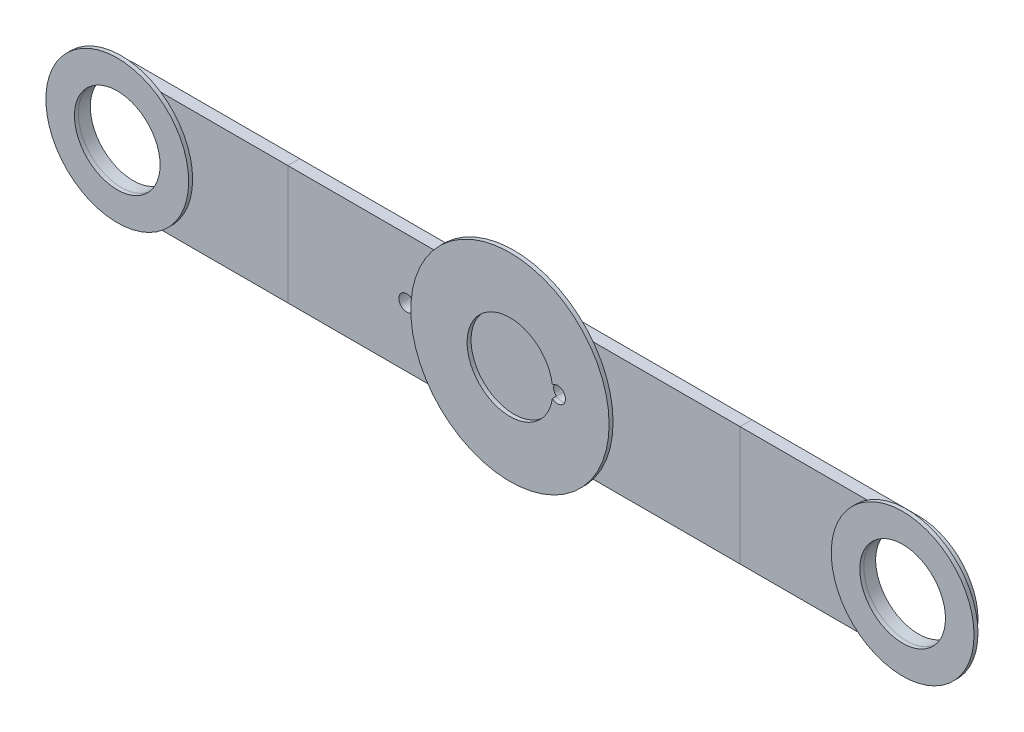
ISO-10303-21;
HEADER;
FILE_DESCRIPTION(('STEP AP214'),'2;1');
FILE_NAME('part.step','',(''),(''),'','','');
FILE_SCHEMA(('AUTOMOTIVE_DESIGN { 1 0 10303 214 1 1 1 1 }'));
ENDSEC;
DATA;
#1=APPLICATION_CONTEXT('core data for automotive mechanical design processes');
#2=APPLICATION_PROTOCOL_DEFINITION('international standard','automotive_design',2000,#1);
#3=PRODUCT_CONTEXT('',#1,'mechanical');
#4=PRODUCT('Part','Part','',(#3));
#5=PRODUCT_RELATED_PRODUCT_CATEGORY('part','',(#4));
#6=PRODUCT_DEFINITION_FORMATION('','',#4);
#7=PRODUCT_DEFINITION_CONTEXT('part definition',#1,'design');
#8=PRODUCT_DEFINITION('design','',#6,#7);
#9=PRODUCT_DEFINITION_SHAPE('','',#8);
#10=(LENGTH_UNIT() NAMED_UNIT(*) SI_UNIT(.MILLI.,.METRE.));
#11=(NAMED_UNIT(*) PLANE_ANGLE_UNIT() SI_UNIT($,.RADIAN.));
#12=(NAMED_UNIT(*) SI_UNIT($,.STERADIAN.) SOLID_ANGLE_UNIT());
#13=UNCERTAINTY_MEASURE_WITH_UNIT(LENGTH_MEASURE(1.E-05),#10,'distance_accuracy_value','');
#14=(GEOMETRIC_REPRESENTATION_CONTEXT(3) GLOBAL_UNCERTAINTY_ASSIGNED_CONTEXT((#13)) GLOBAL_UNIT_ASSIGNED_CONTEXT((#10,
#11,#12)) REPRESENTATION_CONTEXT('',''));
#15=CARTESIAN_POINT('',(0.,0.,0.));
#16=DIRECTION('',(0.,0.,1.));
#17=DIRECTION('',(1.,0.,0.));
#18=AXIS2_PLACEMENT_3D('',#15,#16,#17);
#19=CARTESIAN_POINT('',(0.,0.,0.));
#20=DIRECTION('',(0.,0.,1.));
#21=DIRECTION('',(1.,0.,0.));
#22=AXIS2_PLACEMENT_3D('',#19,#20,#21);
#23=CYLINDRICAL_SURFACE('',#22,5.4);
#24=DIRECTION('',(0.,0.,1.));
#25=VECTOR('',#24,1.);
#26=CARTESIAN_POINT('',(5.34666666666667,0.757070376884185,1.));
#27=LINE('',#26,#25);
#28=CARTESIAN_POINT('',(5.34666666666667,0.757070376884185,0.));
#29=VERTEX_POINT('',#28);
#30=CARTESIAN_POINT('',(5.34666666666667,0.757070376884184,1.5));
#31=VERTEX_POINT('',#30);
#32=EDGE_CURVE('E58',#29,#31,#27,.T.);
#33=ORIENTED_EDGE('',*,*,#32,.F.);
#34=CARTESIAN_POINT('',(0.,0.,0.));
#35=DIRECTION('',(0.,0.,1.));
#36=DIRECTION('',(1.,0.,0.));
#37=AXIS2_PLACEMENT_3D('',#34,#35,#36);
#38=CIRCLE('',#37,5.4);
#39=CARTESIAN_POINT('',(5.34666666666667,-0.757070376884185,0.));
#40=VERTEX_POINT('',#39);
#41=EDGE_CURVE('E52',#29,#40,#38,.T.);
#42=ORIENTED_EDGE('',*,*,#41,.T.);
#43=DIRECTION('',(0.,0.,1.));
#44=VECTOR('',#43,1.);
#45=CARTESIAN_POINT('',(5.34666666666667,-0.757070376884185,1.));
#46=LINE('',#45,#44);
#47=CARTESIAN_POINT('',(5.34666666666667,-0.757070376884184,1.5));
#48=VERTEX_POINT('',#47);
#49=EDGE_CURVE('E69',#48,#40,#46,.F.);
#50=ORIENTED_EDGE('',*,*,#49,.F.);
#51=CARTESIAN_POINT('',(0.,0.,1.5));
#52=DIRECTION('',(0.,0.,1.));
#53=DIRECTION('',(1.,0.,0.));
#54=AXIS2_PLACEMENT_3D('',#51,#52,#53);
#55=CIRCLE('',#54,5.4);
#56=EDGE_CURVE('E77',#31,#48,#55,.T.);
#57=ORIENTED_EDGE('',*,*,#56,.F.);
#58=EDGE_LOOP('',(#33,#42,#50,#57));
#59=FACE_BOUND('',#58,.T.);
#60=ADVANCED_FACE('F45',(#59),#23,.T.);
#61=CARTESIAN_POINT('',(0.,0.,0.));
#62=DIRECTION('',(0.,0.,1.));
#63=DIRECTION('',(1.,0.,0.));
#64=AXIS2_PLACEMENT_3D('',#61,#62,#63);
#65=PLANE('',#64);
#66=ORIENTED_EDGE('',*,*,#41,.F.);
#67=CARTESIAN_POINT('',(6.,0.,0.));
#68=DIRECTION('',(0.,0.,1.));
#69=DIRECTION('',(1.,0.,0.));
#70=AXIS2_PLACEMENT_3D('',#67,#68,#69);
#71=CIRCLE('',#70,1.);
#72=EDGE_CURVE('E67',#29,#40,#71,.T.);
#73=ORIENTED_EDGE('',*,*,#72,.T.);
#74=EDGE_LOOP('',(#66,#73));
#75=FACE_BOUND('',#74,.T.);
#76=ADVANCED_FACE('F79',(#75),#65,.F.);
#77=CARTESIAN_POINT('',(0.,0.,1.5));
#78=DIRECTION('',(0.,0.,1.));
#79=DIRECTION('',(1.,0.,0.));
#80=AXIS2_PLACEMENT_3D('',#77,#78,#79);
#81=PLANE('',#80);
#82=CARTESIAN_POINT('',(6.,0.,1.5));
#83=DIRECTION('',(0.,0.,1.));
#84=DIRECTION('',(1.,0.,0.));
#85=AXIS2_PLACEMENT_3D('',#82,#83,#84);
#86=CIRCLE('',#85,1.);
#87=EDGE_CURVE('E12',#31,#48,#86,.T.);
#88=ORIENTED_EDGE('',*,*,#87,.F.);
#89=ORIENTED_EDGE('',*,*,#56,.T.);
#90=EDGE_LOOP('',(#88,#89));
#91=FACE_BOUND('',#90,.T.);
#92=ADVANCED_FACE('F83',(#91),#81,.T.);
#93=CARTESIAN_POINT('',(6.,0.,0.));
#94=DIRECTION('',(0.,0.,1.));
#95=DIRECTION('',(1.,0.,0.));
#96=AXIS2_PLACEMENT_3D('',#93,#94,#95);
#97=CYLINDRICAL_SURFACE('',#96,1.);
#98=ORIENTED_EDGE('',*,*,#32,.T.);
#99=ORIENTED_EDGE('',*,*,#87,.T.);
#100=ORIENTED_EDGE('',*,*,#49,.T.);
#101=ORIENTED_EDGE('',*,*,#72,.F.);
#102=EDGE_LOOP('',(#98,#99,#100,#101));
#103=FACE_BOUND('',#102,.T.);
#104=ADVANCED_FACE('F68',(#103),#97,.F.);
#105=CLOSED_SHELL('',(#60,#76,#92,#104));
#106=MANIFOLD_SOLID_BREP('B2',#105);
#107=CARTESIAN_POINT('',(-49.5,0.,2.));
#108=DIRECTION('',(0.,0.,1.));
#109=DIRECTION('',(1.,0.,0.));
#110=AXIS2_PLACEMENT_3D('',#107,#108,#109);
#111=PLANE('',#110);
#112=CARTESIAN_POINT('',(-49.5,0.,2.));
#113=DIRECTION('',(0.,0.,1.));
#114=DIRECTION('',(1.,0.,0.));
#115=AXIS2_PLACEMENT_3D('',#112,#113,#114);
#116=CIRCLE('',#115,9.);
#117=CARTESIAN_POINT('',(-40.5,0.,2.));
#118=VERTEX_POINT('',#117);
#119=EDGE_CURVE('E44',#118,#118,#116,.T.);
#120=ORIENTED_EDGE('',*,*,#119,.T.);
#121=EDGE_LOOP('',(#120));
#122=FACE_BOUND('',#121,.T.);
#123=CARTESIAN_POINT('',(-49.5,0.,2.));
#124=DIRECTION('',(0.,0.,1.));
#125=DIRECTION('',(1.,0.,0.));
#126=AXIS2_PLACEMENT_3D('',#123,#124,#125);
#127=CIRCLE('',#126,5.40000000000002);
#128=CARTESIAN_POINT('',(-44.1,0.,2.));
#129=VERTEX_POINT('',#128);
#130=EDGE_CURVE('E135',#129,#129,#127,.T.);
#131=ORIENTED_EDGE('',*,*,#130,.F.);
#132=EDGE_LOOP('',(#131));
#133=FACE_BOUND('',#132,.T.);
#134=ADVANCED_FACE('F124',(#122,#133),#111,.T.);
#135=CARTESIAN_POINT('',(-49.5,0.,1.5));
#136=DIRECTION('',(0.,0.,1.));
#137=DIRECTION('',(1.,0.,0.));
#138=AXIS2_PLACEMENT_3D('',#135,#136,#137);
#139=PLANE('',#138);
#140=CARTESIAN_POINT('',(-49.5,0.,1.5));
#141=DIRECTION('',(0.,0.,1.));
#142=DIRECTION('',(1.,0.,0.));
#143=AXIS2_PLACEMENT_3D('',#140,#141,#142);
#144=CIRCLE('',#143,9.);
#145=CARTESIAN_POINT('',(-40.5,0.,1.5));
#146=VERTEX_POINT('',#145);
#147=EDGE_CURVE('E128',#146,#146,#144,.T.);
#148=ORIENTED_EDGE('',*,*,#147,.F.);
#149=EDGE_LOOP('',(#148));
#150=FACE_BOUND('',#149,.T.);
#151=CARTESIAN_POINT('',(-49.5,0.,1.5));
#152=DIRECTION('',(0.,0.,1.));
#153=DIRECTION('',(1.,0.,0.));
#154=AXIS2_PLACEMENT_3D('',#151,#152,#153);
#155=CIRCLE('',#154,5.40000000000002);
#156=CARTESIAN_POINT('',(-44.1,0.,1.5));
#157=VERTEX_POINT('',#156);
#158=EDGE_CURVE('E137',#157,#157,#155,.T.);
#159=ORIENTED_EDGE('',*,*,#158,.T.);
#160=EDGE_LOOP('',(#159));
#161=FACE_BOUND('',#160,.T.);
#162=ADVANCED_FACE('F147',(#150,#161),#139,.F.);
#163=CARTESIAN_POINT('',(-49.5,0.,2.));
#164=DIRECTION('',(0.,0.,-1.));
#165=DIRECTION('',(-1.,0.,0.));
#166=AXIS2_PLACEMENT_3D('',#163,#164,#165);
#167=CYLINDRICAL_SURFACE('',#166,9.);
#168=ORIENTED_EDGE('',*,*,#119,.F.);
#169=EDGE_LOOP('',(#168));
#170=FACE_BOUND('',#169,.T.);
#171=ORIENTED_EDGE('',*,*,#147,.T.);
#172=EDGE_LOOP('',(#171));
#173=FACE_BOUND('',#172,.T.);
#174=ADVANCED_FACE('F126',(#170,#173),#167,.T.);
#175=CARTESIAN_POINT('',(-49.5,0.,2.));
#176=DIRECTION('',(0.,0.,-1.));
#177=DIRECTION('',(-1.,0.,0.));
#178=AXIS2_PLACEMENT_3D('',#175,#176,#177);
#179=CYLINDRICAL_SURFACE('',#178,5.40000000000002);
#180=ORIENTED_EDGE('',*,*,#130,.T.);
#181=EDGE_LOOP('',(#180));
#182=FACE_BOUND('',#181,.T.);
#183=ORIENTED_EDGE('',*,*,#158,.F.);
#184=EDGE_LOOP('',(#183));
#185=FACE_BOUND('',#184,.T.);
#186=ADVANCED_FACE('F143',(#182,#185),#179,.F.);
#187=CLOSED_SHELL('',(#134,#162,#174,#186));
#188=MANIFOLD_SOLID_BREP('B6',#187);
#189=CARTESIAN_POINT('',(49.5,0.,2.));
#190=DIRECTION('',(0.,0.,1.));
#191=DIRECTION('',(1.,0.,0.));
#192=AXIS2_PLACEMENT_3D('',#189,#190,#191);
#193=PLANE('',#192);
#194=CARTESIAN_POINT('',(49.5,0.,2.));
#195=DIRECTION('',(0.,0.,1.));
#196=DIRECTION('',(1.,0.,0.));
#197=AXIS2_PLACEMENT_3D('',#194,#195,#196);
#198=CIRCLE('',#197,9.);
#199=CARTESIAN_POINT('',(58.5,0.,2.));
#200=VERTEX_POINT('',#199);
#201=EDGE_CURVE('E123',#200,#200,#198,.T.);
#202=ORIENTED_EDGE('',*,*,#201,.T.);
#203=EDGE_LOOP('',(#202));
#204=FACE_BOUND('',#203,.T.);
#205=CARTESIAN_POINT('',(49.5,0.,2.));
#206=DIRECTION('',(0.,0.,1.));
#207=DIRECTION('',(1.,0.,0.));
#208=AXIS2_PLACEMENT_3D('',#205,#206,#207);
#209=CIRCLE('',#208,5.4);
#210=CARTESIAN_POINT('',(54.9,0.,2.));
#211=VERTEX_POINT('',#210);
#212=EDGE_CURVE('E206',#211,#211,#209,.T.);
#213=ORIENTED_EDGE('',*,*,#212,.F.);
#214=EDGE_LOOP('',(#213));
#215=FACE_BOUND('',#214,.T.);
#216=ADVANCED_FACE('F195',(#204,#215),#193,.T.);
#217=CARTESIAN_POINT('',(49.5,0.,1.5));
#218=DIRECTION('',(0.,0.,1.));
#219=DIRECTION('',(1.,0.,0.));
#220=AXIS2_PLACEMENT_3D('',#217,#218,#219);
#221=PLANE('',#220);
#222=CARTESIAN_POINT('',(49.5,0.,1.5));
#223=DIRECTION('',(0.,0.,1.));
#224=DIRECTION('',(1.,0.,0.));
#225=AXIS2_PLACEMENT_3D('',#222,#223,#224);
#226=CIRCLE('',#225,9.);
#227=CARTESIAN_POINT('',(58.5,0.,1.5));
#228=VERTEX_POINT('',#227);
#229=EDGE_CURVE('E199',#228,#228,#226,.T.);
#230=ORIENTED_EDGE('',*,*,#229,.F.);
#231=EDGE_LOOP('',(#230));
#232=FACE_BOUND('',#231,.T.);
#233=CARTESIAN_POINT('',(49.5,0.,1.5));
#234=DIRECTION('',(0.,0.,1.));
#235=DIRECTION('',(1.,0.,0.));
#236=AXIS2_PLACEMENT_3D('',#233,#234,#235);
#237=CIRCLE('',#236,5.4);
#238=CARTESIAN_POINT('',(54.9,0.,1.5));
#239=VERTEX_POINT('',#238);
#240=EDGE_CURVE('E208',#239,#239,#237,.T.);
#241=ORIENTED_EDGE('',*,*,#240,.T.);
#242=EDGE_LOOP('',(#241));
#243=FACE_BOUND('',#242,.T.);
#244=ADVANCED_FACE('F218',(#232,#243),#221,.F.);
#245=CARTESIAN_POINT('',(49.5,0.,2.));
#246=DIRECTION('',(0.,0.,-1.));
#247=DIRECTION('',(-1.,0.,0.));
#248=AXIS2_PLACEMENT_3D('',#245,#246,#247);
#249=CYLINDRICAL_SURFACE('',#248,9.);
#250=ORIENTED_EDGE('',*,*,#201,.F.);
#251=EDGE_LOOP('',(#250));
#252=FACE_BOUND('',#251,.T.);
#253=ORIENTED_EDGE('',*,*,#229,.T.);
#254=EDGE_LOOP('',(#253));
#255=FACE_BOUND('',#254,.T.);
#256=ADVANCED_FACE('F197',(#252,#255),#249,.T.);
#257=CARTESIAN_POINT('',(49.5,0.,2.));
#258=DIRECTION('',(0.,0.,-1.));
#259=DIRECTION('',(-1.,0.,0.));
#260=AXIS2_PLACEMENT_3D('',#257,#258,#259);
#261=CYLINDRICAL_SURFACE('',#260,5.4);
#262=ORIENTED_EDGE('',*,*,#212,.T.);
#263=EDGE_LOOP('',(#262));
#264=FACE_BOUND('',#263,.T.);
#265=ORIENTED_EDGE('',*,*,#240,.F.);
#266=EDGE_LOOP('',(#265));
#267=FACE_BOUND('',#266,.T.);
#268=ADVANCED_FACE('F214',(#264,#267),#261,.F.);
#269=CLOSED_SHELL('',(#216,#244,#256,#268));
#270=MANIFOLD_SOLID_BREP('B39',#269);
#271=CARTESIAN_POINT('',(0.,0.,2.));
#272=DIRECTION('',(0.,0.,1.));
#273=DIRECTION('',(1.,0.,0.));
#274=AXIS2_PLACEMENT_3D('',#271,#272,#273);
#275=PLANE('',#274);
#276=CARTESIAN_POINT('',(6.,0.,2.));
#277=DIRECTION('',(0.,0.,1.));
#278=DIRECTION('',(1.,0.,0.));
#279=AXIS2_PLACEMENT_3D('',#276,#277,#278);
#280=CIRCLE('',#279,1.);
#281=CARTESIAN_POINT('',(5.34666666666667,-0.757070376884185,2.));
#282=VERTEX_POINT('',#281);
#283=CARTESIAN_POINT('',(5.34666666666667,0.757070376884185,2.));
#284=VERTEX_POINT('',#283);
#285=EDGE_CURVE('E280',#282,#284,#280,.T.);
#286=ORIENTED_EDGE('',*,*,#285,.F.);
#287=CARTESIAN_POINT('',(0.,0.,2.));
#288=DIRECTION('',(0.,0.,1.));
#289=DIRECTION('',(1.,0.,0.));
#290=AXIS2_PLACEMENT_3D('',#287,#288,#289);
#291=CIRCLE('',#290,5.4);
#292=EDGE_CURVE('E298',#284,#282,#291,.T.);
#293=ORIENTED_EDGE('',*,*,#292,.F.);
#294=EDGE_LOOP('',(#286,#293));
#295=FACE_BOUND('',#294,.T.);
#296=CARTESIAN_POINT('',(0.,0.,2.));
#297=DIRECTION('',(0.,0.,1.));
#298=DIRECTION('',(1.,0.,0.));
#299=AXIS2_PLACEMENT_3D('',#296,#297,#298);
#300=CIRCLE('',#299,12.5);
#301=CARTESIAN_POINT('',(12.5,0.,2.));
#302=VERTEX_POINT('',#301);
#303=EDGE_CURVE('E305',#302,#302,#300,.T.);
#304=ORIENTED_EDGE('',*,*,#303,.T.);
#305=EDGE_LOOP('',(#304));
#306=FACE_BOUND('',#305,.T.);
#307=ADVANCED_FACE('F266',(#295,#306),#275,.T.);
#308=CARTESIAN_POINT('',(0.,0.,1.5));
#309=DIRECTION('',(0.,0.,1.));
#310=DIRECTION('',(1.,0.,0.));
#311=AXIS2_PLACEMENT_3D('',#308,#309,#310);
#312=PLANE('',#311);
#313=CARTESIAN_POINT('',(0.,0.,1.5));
#314=DIRECTION('',(0.,0.,1.));
#315=DIRECTION('',(1.,0.,0.));
#316=AXIS2_PLACEMENT_3D('',#313,#314,#315);
#317=CIRCLE('',#316,12.5);
#318=CARTESIAN_POINT('',(12.5,0.,1.5));
#319=VERTEX_POINT('',#318);
#320=EDGE_CURVE('E301',#319,#319,#317,.T.);
#321=ORIENTED_EDGE('',*,*,#320,.F.);
#322=EDGE_LOOP('',(#321));
#323=FACE_BOUND('',#322,.T.);
#324=CARTESIAN_POINT('',(0.,0.,1.5));
#325=DIRECTION('',(0.,0.,1.));
#326=DIRECTION('',(1.,0.,0.));
#327=AXIS2_PLACEMENT_3D('',#324,#325,#326);
#328=CIRCLE('',#327,5.4);
#329=CARTESIAN_POINT('',(5.34666666666667,0.757070376884185,1.5));
#330=VERTEX_POINT('',#329);
#331=CARTESIAN_POINT('',(5.34666666666667,-0.757070376884187,1.5));
#332=VERTEX_POINT('',#331);
#333=EDGE_CURVE('E302',#330,#332,#328,.T.);
#334=ORIENTED_EDGE('',*,*,#333,.T.);
#335=CARTESIAN_POINT('',(6.,0.,1.5));
#336=DIRECTION('',(0.,0.,1.));
#337=DIRECTION('',(1.,0.,0.));
#338=AXIS2_PLACEMENT_3D('',#335,#336,#337);
#339=CIRCLE('',#338,1.);
#340=EDGE_CURVE('E285',#332,#330,#339,.T.);
#341=ORIENTED_EDGE('',*,*,#340,.T.);
#342=EDGE_LOOP('',(#334,#341));
#343=FACE_BOUND('',#342,.T.);
#344=ADVANCED_FACE('F312',(#323,#343),#312,.F.);
#345=CARTESIAN_POINT('',(0.,0.,2.));
#346=DIRECTION('',(0.,0.,-1.));
#347=DIRECTION('',(-1.,0.,0.));
#348=AXIS2_PLACEMENT_3D('',#345,#346,#347);
#349=CYLINDRICAL_SURFACE('',#348,12.5);
#350=ORIENTED_EDGE('',*,*,#303,.F.);
#351=EDGE_LOOP('',(#350));
#352=FACE_BOUND('',#351,.T.);
#353=ORIENTED_EDGE('',*,*,#320,.T.);
#354=EDGE_LOOP('',(#353));
#355=FACE_BOUND('',#354,.T.);
#356=ADVANCED_FACE('F268',(#352,#355),#349,.T.);
#357=CARTESIAN_POINT('',(0.,0.,2.));
#358=DIRECTION('',(0.,0.,-1.));
#359=DIRECTION('',(-1.,0.,0.));
#360=AXIS2_PLACEMENT_3D('',#357,#358,#359);
#361=CYLINDRICAL_SURFACE('',#360,5.4);
#362=DIRECTION('',(0.,0.,1.));
#363=VECTOR('',#362,1.);
#364=CARTESIAN_POINT('',(5.34666666666667,-0.757070376884186,1.));
#365=LINE('',#364,#363);
#366=EDGE_CURVE('E193',#332,#282,#365,.T.);
#367=ORIENTED_EDGE('',*,*,#366,.F.);
#368=ORIENTED_EDGE('',*,*,#333,.F.);
#369=DIRECTION('',(0.,0.,1.));
#370=VECTOR('',#369,1.);
#371=CARTESIAN_POINT('',(5.34666666666667,0.757070376884186,1.));
#372=LINE('',#371,#370);
#373=EDGE_CURVE('E274',#284,#330,#372,.F.);
#374=ORIENTED_EDGE('',*,*,#373,.F.);
#375=ORIENTED_EDGE('',*,*,#292,.T.);
#376=EDGE_LOOP('',(#367,#368,#374,#375));
#377=FACE_BOUND('',#376,.T.);
#378=ADVANCED_FACE('F300',(#377),#361,.F.);
#379=CARTESIAN_POINT('',(6.,0.,0.));
#380=DIRECTION('',(0.,0.,1.));
#381=DIRECTION('',(1.,0.,0.));
#382=AXIS2_PLACEMENT_3D('',#379,#380,#381);
#383=CYLINDRICAL_SURFACE('',#382,1.);
#384=ORIENTED_EDGE('',*,*,#366,.T.);
#385=ORIENTED_EDGE('',*,*,#285,.T.);
#386=ORIENTED_EDGE('',*,*,#373,.T.);
#387=ORIENTED_EDGE('',*,*,#340,.F.);
#388=EDGE_LOOP('',(#384,#385,#386,#387));
#389=FACE_BOUND('',#388,.T.);
#390=ADVANCED_FACE('F290',(#389),#383,.F.);
#391=CLOSED_SHELL('',(#307,#344,#356,#378,#390));
#392=MANIFOLD_SOLID_BREP('B118',#391);
#393=CARTESIAN_POINT('',(28.5,-7.5,0.));
#394=DIRECTION('',(1.,0.,0.));
#395=DIRECTION('',(0.,0.,-1.));
#396=AXIS2_PLACEMENT_3D('',#393,#394,#395);
#397=PLANE('',#396);
#398=DIRECTION('',(0.,1.,0.));
#399=VECTOR('',#398,1.);
#400=CARTESIAN_POINT('',(28.5,-7.5,1.5));
#401=LINE('',#400,#399);
#402=CARTESIAN_POINT('',(28.5,-7.5,1.5));
#403=VERTEX_POINT('',#402);
#404=CARTESIAN_POINT('',(28.5,7.5,1.5));
#405=VERTEX_POINT('',#404);
#406=EDGE_CURVE('E442',#403,#405,#401,.T.);
#407=ORIENTED_EDGE('',*,*,#406,.F.);
#408=DIRECTION('',(0.,0.,1.));
#409=VECTOR('',#408,1.);
#410=CARTESIAN_POINT('',(28.5,-7.5,0.));
#411=LINE('',#410,#409);
#412=CARTESIAN_POINT('',(28.5,-7.5,0.));
#413=VERTEX_POINT('',#412);
#414=EDGE_CURVE('E392',#413,#403,#411,.T.);
#415=ORIENTED_EDGE('',*,*,#414,.F.);
#416=DIRECTION('',(0.,1.,0.));
#417=VECTOR('',#416,1.);
#418=CARTESIAN_POINT('',(28.5,-7.5,0.));
#419=LINE('',#418,#417);
#420=CARTESIAN_POINT('',(28.5,7.5,0.));
#421=VERTEX_POINT('',#420);
#422=EDGE_CURVE('E451',#413,#421,#419,.T.);
#423=ORIENTED_EDGE('',*,*,#422,.T.);
#424=DIRECTION('',(0.,0.,1.));
#425=VECTOR('',#424,1.);
#426=CARTESIAN_POINT('',(28.5,7.5,0.));
#427=LINE('',#426,#425);
#428=EDGE_CURVE('E418',#421,#405,#427,.T.);
#429=ORIENTED_EDGE('',*,*,#428,.T.);
#430=EDGE_LOOP('',(#407,#415,#423,#429));
#431=FACE_BOUND('',#430,.T.);
#432=ADVANCED_FACE('F368',(#431),#397,.T.);
#433=CARTESIAN_POINT('',(-28.5,-7.5,0.));
#434=DIRECTION('',(0.,-1.,0.));
#435=DIRECTION('',(0.,0.,-1.));
#436=AXIS2_PLACEMENT_3D('',#433,#434,#435);
#437=PLANE('',#436);
#438=DIRECTION('',(1.,0.,0.));
#439=VECTOR('',#438,1.);
#440=CARTESIAN_POINT('',(-28.5,-7.5,1.5));
#441=LINE('',#440,#439);
#442=CARTESIAN_POINT('',(-28.5,-7.5,1.5));
#443=VERTEX_POINT('',#442);
#444=EDGE_CURVE('E454',#443,#403,#441,.T.);
#445=ORIENTED_EDGE('',*,*,#444,.F.);
#446=DIRECTION('',(0.,0.,1.));
#447=VECTOR('',#446,1.);
#448=CARTESIAN_POINT('',(-28.5,-7.5,0.));
#449=LINE('',#448,#447);
#450=CARTESIAN_POINT('',(-28.5,-7.5,0.));
#451=VERTEX_POINT('',#450);
#452=EDGE_CURVE('E469',#451,#443,#449,.T.);
#453=ORIENTED_EDGE('',*,*,#452,.F.);
#454=DIRECTION('',(1.,0.,0.));
#455=VECTOR('',#454,1.);
#456=CARTESIAN_POINT('',(-28.5,-7.5,0.));
#457=LINE('',#456,#455);
#458=EDGE_CURVE('E459',#451,#413,#457,.T.);
#459=ORIENTED_EDGE('',*,*,#458,.T.);
#460=ORIENTED_EDGE('',*,*,#414,.T.);
#461=EDGE_LOOP('',(#445,#453,#459,#460));
#462=FACE_BOUND('',#461,.T.);
#463=ADVANCED_FACE('F478',(#462),#437,.T.);
#464=CARTESIAN_POINT('',(-28.5,-7.5,0.));
#465=DIRECTION('',(-1.,0.,0.));
#466=DIRECTION('',(0.,0.,1.));
#467=AXIS2_PLACEMENT_3D('',#464,#465,#466);
#468=PLANE('',#467);
#469=DIRECTION('',(0.,-1.,0.));
#470=VECTOR('',#469,1.);
#471=CARTESIAN_POINT('',(-28.5,-7.5,1.5));
#472=LINE('',#471,#470);
#473=CARTESIAN_POINT('',(-28.5,7.5,1.5));
#474=VERTEX_POINT('',#473);
#475=EDGE_CURVE('E463',#474,#443,#472,.T.);
#476=ORIENTED_EDGE('',*,*,#475,.F.);
#477=DIRECTION('',(0.,0.,1.));
#478=VECTOR('',#477,1.);
#479=CARTESIAN_POINT('',(-28.5,7.5,0.));
#480=LINE('',#479,#478);
#481=CARTESIAN_POINT('',(-28.5,7.5,0.));
#482=VERTEX_POINT('',#481);
#483=EDGE_CURVE('E471',#482,#474,#480,.T.);
#484=ORIENTED_EDGE('',*,*,#483,.F.);
#485=DIRECTION('',(0.,-1.,0.));
#486=VECTOR('',#485,1.);
#487=CARTESIAN_POINT('',(-28.5,-7.5,0.));
#488=LINE('',#487,#486);
#489=EDGE_CURVE('E456',#482,#451,#488,.T.);
#490=ORIENTED_EDGE('',*,*,#489,.T.);
#491=ORIENTED_EDGE('',*,*,#452,.T.);
#492=EDGE_LOOP('',(#476,#484,#490,#491));
#493=FACE_BOUND('',#492,.T.);
#494=ADVANCED_FACE('F482',(#493),#468,.T.);
#495=CARTESIAN_POINT('',(-28.5,7.5,0.));
#496=DIRECTION('',(0.,1.,0.));
#497=DIRECTION('',(0.,0.,1.));
#498=AXIS2_PLACEMENT_3D('',#495,#496,#497);
#499=PLANE('',#498);
#500=DIRECTION('',(-1.,0.,0.));
#501=VECTOR('',#500,1.);
#502=CARTESIAN_POINT('',(-28.5,7.5,1.5));
#503=LINE('',#502,#501);
#504=EDGE_CURVE('E446',#405,#474,#503,.T.);
#505=ORIENTED_EDGE('',*,*,#504,.F.);
#506=ORIENTED_EDGE('',*,*,#428,.F.);
#507=DIRECTION('',(-1.,0.,0.));
#508=VECTOR('',#507,1.);
#509=CARTESIAN_POINT('',(-28.5,7.5,0.));
#510=LINE('',#509,#508);
#511=EDGE_CURVE('E453',#421,#482,#510,.T.);
#512=ORIENTED_EDGE('',*,*,#511,.T.);
#513=ORIENTED_EDGE('',*,*,#483,.T.);
#514=EDGE_LOOP('',(#505,#506,#512,#513));
#515=FACE_BOUND('',#514,.T.);
#516=ADVANCED_FACE('F474',(#515),#499,.T.);
#517=CARTESIAN_POINT('',(0.,0.,0.));
#518=DIRECTION('',(0.,0.,-1.));
#519=DIRECTION('',(-1.,0.,0.));
#520=AXIS2_PLACEMENT_3D('',#517,#518,#519);
#521=PLANE('',#520);
#522=CARTESIAN_POINT('',(-13.5,0.,0.));
#523=DIRECTION('',(0.,0.,1.));
#524=DIRECTION('',(1.,0.,0.));
#525=AXIS2_PLACEMENT_3D('',#522,#523,#524);
#526=CIRCLE('',#525,1.);
#527=CARTESIAN_POINT('',(-12.5,0.,0.));
#528=VERTEX_POINT('',#527);
#529=EDGE_CURVE('E439',#528,#528,#526,.T.);
#530=ORIENTED_EDGE('',*,*,#529,.T.);
#531=EDGE_LOOP('',(#530));
#532=FACE_BOUND('',#531,.T.);
#533=CARTESIAN_POINT('',(6.,0.,0.));
#534=DIRECTION('',(0.,0.,1.));
#535=DIRECTION('',(1.,0.,0.));
#536=AXIS2_PLACEMENT_3D('',#533,#534,#535);
#537=CIRCLE('',#536,1.);
#538=CARTESIAN_POINT('',(5.34666666666667,-0.757070376884185,0.));
#539=VERTEX_POINT('',#538);
#540=CARTESIAN_POINT('',(5.34666666666667,0.757070376884185,0.));
#541=VERTEX_POINT('',#540);
#542=EDGE_CURVE('E383',#539,#541,#537,.T.);
#543=ORIENTED_EDGE('',*,*,#542,.T.);
#544=CARTESIAN_POINT('',(0.,0.,0.));
#545=DIRECTION('',(0.,0.,1.));
#546=DIRECTION('',(1.,0.,0.));
#547=AXIS2_PLACEMENT_3D('',#544,#545,#546);
#548=CIRCLE('',#547,5.4);
#549=EDGE_CURVE('E438',#541,#539,#548,.T.);
#550=ORIENTED_EDGE('',*,*,#549,.T.);
#551=EDGE_LOOP('',(#543,#550));
#552=FACE_BOUND('',#551,.T.);
#553=ORIENTED_EDGE('',*,*,#422,.F.);
#554=ORIENTED_EDGE('',*,*,#458,.F.);
#555=ORIENTED_EDGE('',*,*,#489,.F.);
#556=ORIENTED_EDGE('',*,*,#511,.F.);
#557=EDGE_LOOP('',(#553,#554,#555,#556));
#558=FACE_BOUND('',#557,.T.);
#559=ADVANCED_FACE('F436',(#532,#552,#558),#521,.T.);
#560=CARTESIAN_POINT('',(0.,0.,1.5));
#561=DIRECTION('',(0.,0.,-1.));
#562=DIRECTION('',(-1.,0.,0.));
#563=AXIS2_PLACEMENT_3D('',#560,#561,#562);
#564=PLANE('',#563);
#565=CARTESIAN_POINT('',(-13.5,0.,1.5));
#566=DIRECTION('',(0.,0.,-1.));
#567=DIRECTION('',(-1.,0.,0.));
#568=AXIS2_PLACEMENT_3D('',#565,#566,#567);
#569=CIRCLE('',#568,1.);
#570=CARTESIAN_POINT('',(-14.5,0.,1.5));
#571=VERTEX_POINT('',#570);
#572=EDGE_CURVE('E371',#571,#571,#569,.T.);
#573=ORIENTED_EDGE('',*,*,#572,.T.);
#574=EDGE_LOOP('',(#573));
#575=FACE_BOUND('',#574,.T.);
#576=CARTESIAN_POINT('',(0.,0.,1.5));
#577=DIRECTION('',(0.,0.,1.));
#578=DIRECTION('',(1.,0.,0.));
#579=AXIS2_PLACEMENT_3D('',#576,#577,#578);
#580=CIRCLE('',#579,5.4);
#581=CARTESIAN_POINT('',(5.34666666666667,0.757070376884184,1.5));
#582=VERTEX_POINT('',#581);
#583=CARTESIAN_POINT('',(5.34666666666667,-0.757070376884184,1.5));
#584=VERTEX_POINT('',#583);
#585=EDGE_CURVE('E443',#582,#584,#580,.T.);
#586=ORIENTED_EDGE('',*,*,#585,.F.);
#587=CARTESIAN_POINT('',(6.,0.,1.5));
#588=DIRECTION('',(0.,0.,-1.));
#589=DIRECTION('',(-1.,0.,0.));
#590=AXIS2_PLACEMENT_3D('',#587,#588,#589);
#591=CIRCLE('',#590,1.);
#592=EDGE_CURVE('E429',#582,#584,#591,.T.);
#593=ORIENTED_EDGE('',*,*,#592,.T.);
#594=EDGE_LOOP('',(#586,#593));
#595=FACE_BOUND('',#594,.T.);
#596=ORIENTED_EDGE('',*,*,#406,.T.);
#597=ORIENTED_EDGE('',*,*,#504,.T.);
#598=ORIENTED_EDGE('',*,*,#475,.T.);
#599=ORIENTED_EDGE('',*,*,#444,.T.);
#600=EDGE_LOOP('',(#596,#597,#598,#599));
#601=FACE_BOUND('',#600,.T.);
#602=ADVANCED_FACE('F477',(#575,#595,#601),#564,.F.);
#603=CARTESIAN_POINT('',(0.,0.,0.));
#604=DIRECTION('',(0.,0.,1.));
#605=DIRECTION('',(1.,0.,0.));
#606=AXIS2_PLACEMENT_3D('',#603,#604,#605);
#607=CYLINDRICAL_SURFACE('',#606,5.4);
#608=ORIENTED_EDGE('',*,*,#549,.F.);
#609=DIRECTION('',(0.,0.,1.));
#610=VECTOR('',#609,1.);
#611=CARTESIAN_POINT('',(5.34666666666667,0.757070376884184,1.));
#612=LINE('',#611,#610);
#613=EDGE_CURVE('E264',#541,#582,#612,.T.);
#614=ORIENTED_EDGE('',*,*,#613,.T.);
#615=ORIENTED_EDGE('',*,*,#585,.T.);
#616=DIRECTION('',(0.,0.,1.));
#617=VECTOR('',#616,1.);
#618=CARTESIAN_POINT('',(5.34666666666667,-0.757070376884185,1.));
#619=LINE('',#618,#617);
#620=EDGE_CURVE('E376',#584,#539,#619,.F.);
#621=ORIENTED_EDGE('',*,*,#620,.T.);
#622=EDGE_LOOP('',(#608,#614,#615,#621));
#623=FACE_BOUND('',#622,.T.);
#624=ADVANCED_FACE('F441',(#623),#607,.F.);
#625=CARTESIAN_POINT('',(6.,0.,0.));
#626=DIRECTION('',(0.,0.,1.));
#627=DIRECTION('',(1.,0.,0.));
#628=AXIS2_PLACEMENT_3D('',#625,#626,#627);
#629=CYLINDRICAL_SURFACE('',#628,1.);
#630=ORIENTED_EDGE('',*,*,#542,.F.);
#631=ORIENTED_EDGE('',*,*,#620,.F.);
#632=ORIENTED_EDGE('',*,*,#592,.F.);
#633=ORIENTED_EDGE('',*,*,#613,.F.);
#634=EDGE_LOOP('',(#630,#631,#632,#633));
#635=FACE_BOUND('',#634,.T.);
#636=ADVANCED_FACE('F427',(#635),#629,.F.);
#637=CARTESIAN_POINT('',(-13.5,0.,0.));
#638=DIRECTION('',(0.,0.,1.));
#639=DIRECTION('',(1.,0.,0.));
#640=AXIS2_PLACEMENT_3D('',#637,#638,#639);
#641=CYLINDRICAL_SURFACE('',#640,1.);
#642=ORIENTED_EDGE('',*,*,#529,.F.);
#643=EDGE_LOOP('',(#642));
#644=FACE_BOUND('',#643,.T.);
#645=ORIENTED_EDGE('',*,*,#572,.F.);
#646=EDGE_LOOP('',(#645));
#647=FACE_BOUND('',#646,.T.);
#648=ADVANCED_FACE('F535',(#644,#647),#641,.F.);
#649=CLOSED_SHELL('',(#432,#463,#494,#516,#559,#602,#624,#636,#648));
#650=MANIFOLD_SOLID_BREP('B187',#649);
#651=CARTESIAN_POINT('',(0.,-7.5,1.5));
#652=DIRECTION('',(0.,-1.,0.));
#653=DIRECTION('',(0.,0.,-1.));
#654=AXIS2_PLACEMENT_3D('',#651,#652,#653);
#655=PLANE('',#654);
#656=DIRECTION('',(-1.,0.,0.));
#657=VECTOR('',#656,1.);
#658=CARTESIAN_POINT('',(0.,-7.5,0.));
#659=LINE('',#658,#657);
#660=CARTESIAN_POINT('',(49.5,-7.5,0.));
#661=VERTEX_POINT('',#660);
#662=CARTESIAN_POINT('',(28.5,-7.5,0.));
#663=VERTEX_POINT('',#662);
#664=EDGE_CURVE('E642',#661,#663,#659,.T.);
#665=ORIENTED_EDGE('',*,*,#664,.F.);
#666=DIRECTION('',(0.,0.,-1.));
#667=VECTOR('',#666,1.);
#668=CARTESIAN_POINT('',(49.5,-7.5,1.5));
#669=LINE('',#668,#667);
#670=CARTESIAN_POINT('',(49.5,-7.5,1.5));
#671=VERTEX_POINT('',#670);
#672=EDGE_CURVE('E366',#671,#661,#669,.T.);
#673=ORIENTED_EDGE('',*,*,#672,.F.);
#674=DIRECTION('',(-1.,0.,0.));
#675=VECTOR('',#674,1.);
#676=CARTESIAN_POINT('',(0.,-7.5,1.5));
#677=LINE('',#676,#675);
#678=CARTESIAN_POINT('',(28.5,-7.5,1.5));
#679=VERTEX_POINT('',#678);
#680=EDGE_CURVE('E624',#671,#679,#677,.T.);
#681=ORIENTED_EDGE('',*,*,#680,.T.);
#682=DIRECTION('',(0.,0.,-1.));
#683=VECTOR('',#682,1.);
#684=CARTESIAN_POINT('',(28.5,-7.5,1.5));
#685=LINE('',#684,#683);
#686=EDGE_CURVE('E592',#679,#663,#685,.T.);
#687=ORIENTED_EDGE('',*,*,#686,.T.);
#688=EDGE_LOOP('',(#665,#673,#681,#687));
#689=FACE_BOUND('',#688,.T.);
#690=ADVANCED_FACE('F575',(#689),#655,.T.);
#691=CARTESIAN_POINT('',(49.5,0.,1.5));
#692=DIRECTION('',(0.,0.,-1.));
#693=DIRECTION('',(-1.,0.,0.));
#694=AXIS2_PLACEMENT_3D('',#691,#692,#693);
#695=CYLINDRICAL_SURFACE('',#694,7.5);
#696=CARTESIAN_POINT('',(49.5,0.,0.));
#697=DIRECTION('',(0.,0.,1.));
#698=DIRECTION('',(1.,0.,0.));
#699=AXIS2_PLACEMENT_3D('',#696,#697,#698);
#700=CIRCLE('',#699,7.5);
#701=CARTESIAN_POINT('',(49.5,7.5,0.));
#702=VERTEX_POINT('',#701);
#703=EDGE_CURVE('E630',#661,#702,#700,.T.);
#704=ORIENTED_EDGE('',*,*,#703,.T.);
#705=DIRECTION('',(0.,0.,-1.));
#706=VECTOR('',#705,1.);
#707=CARTESIAN_POINT('',(49.5,7.5,1.5));
#708=LINE('',#707,#706);
#709=CARTESIAN_POINT('',(49.5,7.5,1.5));
#710=VERTEX_POINT('',#709);
#711=EDGE_CURVE('E584',#710,#702,#708,.T.);
#712=ORIENTED_EDGE('',*,*,#711,.F.);
#713=CARTESIAN_POINT('',(49.5,0.,1.5));
#714=DIRECTION('',(0.,0.,1.));
#715=DIRECTION('',(1.,0.,0.));
#716=AXIS2_PLACEMENT_3D('',#713,#714,#715);
#717=CIRCLE('',#716,7.5);
#718=EDGE_CURVE('E618',#671,#710,#717,.T.);
#719=ORIENTED_EDGE('',*,*,#718,.F.);
#720=ORIENTED_EDGE('',*,*,#672,.T.);
#721=EDGE_LOOP('',(#704,#712,#719,#720));
#722=FACE_BOUND('',#721,.T.);
#723=ADVANCED_FACE('F628',(#722),#695,.T.);
#724=CARTESIAN_POINT('',(0.,7.5,1.5));
#725=DIRECTION('',(0.,1.,0.));
#726=DIRECTION('',(0.,0.,1.));
#727=AXIS2_PLACEMENT_3D('',#724,#725,#726);
#728=PLANE('',#727);
#729=DIRECTION('',(1.,0.,0.));
#730=VECTOR('',#729,1.);
#731=CARTESIAN_POINT('',(0.,7.5,0.));
#732=LINE('',#731,#730);
#733=CARTESIAN_POINT('',(28.5,7.5,0.));
#734=VERTEX_POINT('',#733);
#735=EDGE_CURVE('E645',#734,#702,#732,.T.);
#736=ORIENTED_EDGE('',*,*,#735,.F.);
#737=DIRECTION('',(0.,0.,-1.));
#738=VECTOR('',#737,1.);
#739=CARTESIAN_POINT('',(28.5,7.5,1.5));
#740=LINE('',#739,#738);
#741=CARTESIAN_POINT('',(28.5,7.5,1.5));
#742=VERTEX_POINT('',#741);
#743=EDGE_CURVE('E605',#742,#734,#740,.T.);
#744=ORIENTED_EDGE('',*,*,#743,.F.);
#745=DIRECTION('',(1.,0.,0.));
#746=VECTOR('',#745,1.);
#747=CARTESIAN_POINT('',(0.,7.5,1.5));
#748=LINE('',#747,#746);
#749=EDGE_CURVE('E623',#742,#710,#748,.T.);
#750=ORIENTED_EDGE('',*,*,#749,.T.);
#751=ORIENTED_EDGE('',*,*,#711,.T.);
#752=EDGE_LOOP('',(#736,#744,#750,#751));
#753=FACE_BOUND('',#752,.T.);
#754=ADVANCED_FACE('F633',(#753),#728,.T.);
#755=CARTESIAN_POINT('',(49.5,0.,1.5));
#756=DIRECTION('',(0.,0.,-1.));
#757=DIRECTION('',(-1.,0.,0.));
#758=AXIS2_PLACEMENT_3D('',#755,#756,#757);
#759=CYLINDRICAL_SURFACE('',#758,5.4);
#760=CARTESIAN_POINT('',(49.5,0.,1.5));
#761=DIRECTION('',(0.,0.,1.));
#762=DIRECTION('',(1.,0.,0.));
#763=AXIS2_PLACEMENT_3D('',#760,#761,#762);
#764=CIRCLE('',#763,5.4);
#765=CARTESIAN_POINT('',(54.9,0.,1.5));
#766=VERTEX_POINT('',#765);
#767=EDGE_CURVE('E650',#766,#766,#764,.T.);
#768=ORIENTED_EDGE('',*,*,#767,.T.);
#769=EDGE_LOOP('',(#768));
#770=FACE_BOUND('',#769,.T.);
#771=CARTESIAN_POINT('',(49.5,0.,0.));
#772=DIRECTION('',(0.,0.,1.));
#773=DIRECTION('',(1.,0.,0.));
#774=AXIS2_PLACEMENT_3D('',#771,#772,#773);
#775=CIRCLE('',#774,5.4);
#776=CARTESIAN_POINT('',(54.9,0.,0.));
#777=VERTEX_POINT('',#776);
#778=EDGE_CURVE('E639',#777,#777,#775,.T.);
#779=ORIENTED_EDGE('',*,*,#778,.F.);
#780=EDGE_LOOP('',(#779));
#781=FACE_BOUND('',#780,.T.);
#782=ADVANCED_FACE('F577',(#770,#781),#759,.F.);
#783=CARTESIAN_POINT('',(28.5,0.,1.5));
#784=DIRECTION('',(-1.,0.,0.));
#785=DIRECTION('',(0.,0.,1.));
#786=AXIS2_PLACEMENT_3D('',#783,#784,#785);
#787=PLANE('',#786);
#788=DIRECTION('',(0.,1.,0.));
#789=VECTOR('',#788,1.);
#790=CARTESIAN_POINT('',(28.5,0.,0.));
#791=LINE('',#790,#789);
#792=EDGE_CURVE('E647',#663,#734,#791,.T.);
#793=ORIENTED_EDGE('',*,*,#792,.F.);
#794=ORIENTED_EDGE('',*,*,#686,.F.);
#795=DIRECTION('',(0.,1.,0.));
#796=VECTOR('',#795,1.);
#797=CARTESIAN_POINT('',(28.5,0.,1.5));
#798=LINE('',#797,#796);
#799=EDGE_CURVE('E634',#679,#742,#798,.T.);
#800=ORIENTED_EDGE('',*,*,#799,.T.);
#801=ORIENTED_EDGE('',*,*,#743,.T.);
#802=EDGE_LOOP('',(#793,#794,#800,#801));
#803=FACE_BOUND('',#802,.T.);
#804=ADVANCED_FACE('F657',(#803),#787,.T.);
#805=CARTESIAN_POINT('',(0.,0.,1.5));
#806=DIRECTION('',(0.,0.,1.));
#807=DIRECTION('',(1.,0.,0.));
#808=AXIS2_PLACEMENT_3D('',#805,#806,#807);
#809=PLANE('',#808);
#810=ORIENTED_EDGE('',*,*,#767,.F.);
#811=EDGE_LOOP('',(#810));
#812=FACE_BOUND('',#811,.T.);
#813=ORIENTED_EDGE('',*,*,#680,.F.);
#814=ORIENTED_EDGE('',*,*,#718,.T.);
#815=ORIENTED_EDGE('',*,*,#749,.F.);
#816=ORIENTED_EDGE('',*,*,#799,.F.);
#817=EDGE_LOOP('',(#813,#814,#815,#816));
#818=FACE_BOUND('',#817,.T.);
#819=ADVANCED_FACE('F620',(#812,#818),#809,.T.);
#820=CARTESIAN_POINT('',(0.,0.,0.));
#821=DIRECTION('',(0.,0.,1.));
#822=DIRECTION('',(1.,0.,0.));
#823=AXIS2_PLACEMENT_3D('',#820,#821,#822);
#824=PLANE('',#823);
#825=ORIENTED_EDGE('',*,*,#778,.T.);
#826=EDGE_LOOP('',(#825));
#827=FACE_BOUND('',#826,.T.);
#828=ORIENTED_EDGE('',*,*,#664,.T.);
#829=ORIENTED_EDGE('',*,*,#792,.T.);
#830=ORIENTED_EDGE('',*,*,#735,.T.);
#831=ORIENTED_EDGE('',*,*,#703,.F.);
#832=EDGE_LOOP('',(#828,#829,#830,#831));
#833=FACE_BOUND('',#832,.T.);
#834=ADVANCED_FACE('F664',(#827,#833),#824,.F.);
#835=CLOSED_SHELL('',(#690,#723,#754,#782,#804,#819,#834));
#836=MANIFOLD_SOLID_BREP('B258',#835);
#837=CARTESIAN_POINT('',(-49.5,0.,1.5));
#838=DIRECTION('',(0.,0.,-1.));
#839=DIRECTION('',(-1.,0.,0.));
#840=AXIS2_PLACEMENT_3D('',#837,#838,#839);
#841=CYLINDRICAL_SURFACE('',#840,7.49999999999999);
#842=CARTESIAN_POINT('',(-49.5,0.,0.));
#843=DIRECTION('',(0.,0.,1.));
#844=DIRECTION('',(1.,0.,0.));
#845=AXIS2_PLACEMENT_3D('',#842,#843,#844);
#846=CIRCLE('',#845,7.49999999999999);
#847=CARTESIAN_POINT('',(-49.5,-7.49999999999999,0.));
#848=VERTEX_POINT('',#847);
#849=CARTESIAN_POINT('',(-49.5,7.49999999999999,0.));
#850=VERTEX_POINT('',#849);
#851=EDGE_CURVE('E785',#848,#850,#846,.F.);
#852=ORIENTED_EDGE('',*,*,#851,.F.);
#853=DIRECTION('',(0.,0.,-1.));
#854=VECTOR('',#853,1.);
#855=CARTESIAN_POINT('',(-49.5,-7.49999999999999,1.5));
#856=LINE('',#855,#854);
#857=CARTESIAN_POINT('',(-49.5,-7.49999999999999,1.5));
#858=VERTEX_POINT('',#857);
#859=EDGE_CURVE('E573',#858,#848,#856,.T.);
#860=ORIENTED_EDGE('',*,*,#859,.F.);
#861=CARTESIAN_POINT('',(-49.5,0.,1.5));
#862=DIRECTION('',(0.,0.,1.));
#863=DIRECTION('',(1.,0.,0.));
#864=AXIS2_PLACEMENT_3D('',#861,#862,#863);
#865=CIRCLE('',#864,7.49999999999999);
#866=CARTESIAN_POINT('',(-49.5,7.49999999999999,1.5));
#867=VERTEX_POINT('',#866);
#868=EDGE_CURVE('E770',#858,#867,#865,.F.);
#869=ORIENTED_EDGE('',*,*,#868,.T.);
#870=DIRECTION('',(0.,0.,-1.));
#871=VECTOR('',#870,1.);
#872=CARTESIAN_POINT('',(-49.5,7.49999999999999,1.5));
#873=LINE('',#872,#871);
#874=EDGE_CURVE('E758',#867,#850,#873,.T.);
#875=ORIENTED_EDGE('',*,*,#874,.T.);
#876=EDGE_LOOP('',(#852,#860,#869,#875));
#877=FACE_BOUND('',#876,.T.);
#878=ADVANCED_FACE('F719',(#877),#841,.T.);
#879=CARTESIAN_POINT('',(0.,-7.50000000000002,1.5));
#880=DIRECTION('',(0.,1.,0.));
#881=DIRECTION('',(-1.,0.,0.));
#882=AXIS2_PLACEMENT_3D('',#879,#880,#881);
#883=PLANE('',#882);
#884=DIRECTION('',(1.,0.,0.));
#885=VECTOR('',#884,1.);
#886=CARTESIAN_POINT('',(0.,-7.50000000000002,0.));
#887=LINE('',#886,#885);
#888=CARTESIAN_POINT('',(-28.5,-7.5,0.));
#889=VERTEX_POINT('',#888);
#890=EDGE_CURVE('E775',#848,#889,#887,.T.);
#891=ORIENTED_EDGE('',*,*,#890,.T.);
#892=DIRECTION('',(0.,0.,-1.));
#893=VECTOR('',#892,1.);
#894=CARTESIAN_POINT('',(-28.5,-7.5,1.5));
#895=LINE('',#894,#893);
#896=CARTESIAN_POINT('',(-28.5,-7.5,1.5));
#897=VERTEX_POINT('',#896);
#898=EDGE_CURVE('E727',#897,#889,#895,.T.);
#899=ORIENTED_EDGE('',*,*,#898,.F.);
#900=DIRECTION('',(1.,0.,0.));
#901=VECTOR('',#900,1.);
#902=CARTESIAN_POINT('',(0.,-7.50000000000002,1.5));
#903=LINE('',#902,#901);
#904=EDGE_CURVE('E764',#858,#897,#903,.T.);
#905=ORIENTED_EDGE('',*,*,#904,.F.);
#906=ORIENTED_EDGE('',*,*,#859,.T.);
#907=EDGE_LOOP('',(#891,#899,#905,#906));
#908=FACE_BOUND('',#907,.T.);
#909=ADVANCED_FACE('F773',(#908),#883,.F.);
#910=CARTESIAN_POINT('',(-28.5,0.,1.5));
#911=DIRECTION('',(-1.,0.,0.));
#912=DIRECTION('',(0.,0.,1.));
#913=AXIS2_PLACEMENT_3D('',#910,#911,#912);
#914=PLANE('',#913);
#915=DIRECTION('',(0.,1.,0.));
#916=VECTOR('',#915,1.);
#917=CARTESIAN_POINT('',(-28.5,0.,0.));
#918=LINE('',#917,#916);
#919=CARTESIAN_POINT('',(-28.5,7.5,0.));
#920=VERTEX_POINT('',#919);
#921=EDGE_CURVE('E751',#889,#920,#918,.T.);
#922=ORIENTED_EDGE('',*,*,#921,.T.);
#923=DIRECTION('',(0.,0.,-1.));
#924=VECTOR('',#923,1.);
#925=CARTESIAN_POINT('',(-28.5,7.5,1.5));
#926=LINE('',#925,#924);
#927=CARTESIAN_POINT('',(-28.5,7.5,1.5));
#928=VERTEX_POINT('',#927);
#929=EDGE_CURVE('E776',#928,#920,#926,.T.);
#930=ORIENTED_EDGE('',*,*,#929,.F.);
#931=DIRECTION('',(0.,1.,0.));
#932=VECTOR('',#931,1.);
#933=CARTESIAN_POINT('',(-28.5,0.,1.5));
#934=LINE('',#933,#932);
#935=EDGE_CURVE('E769',#897,#928,#934,.T.);
#936=ORIENTED_EDGE('',*,*,#935,.F.);
#937=ORIENTED_EDGE('',*,*,#898,.T.);
#938=EDGE_LOOP('',(#922,#930,#936,#937));
#939=FACE_BOUND('',#938,.T.);
#940=ADVANCED_FACE('F777',(#939),#914,.F.);
#941=CARTESIAN_POINT('',(0.,7.50000000000002,1.5));
#942=DIRECTION('',(0.,-1.,0.));
#943=DIRECTION('',(1.,0.,0.));
#944=AXIS2_PLACEMENT_3D('',#941,#942,#943);
#945=PLANE('',#944);
#946=DIRECTION('',(-1.,0.,0.));
#947=VECTOR('',#946,1.);
#948=CARTESIAN_POINT('',(0.,7.50000000000002,0.));
#949=LINE('',#948,#947);
#950=EDGE_CURVE('E790',#920,#850,#949,.T.);
#951=ORIENTED_EDGE('',*,*,#950,.T.);
#952=ORIENTED_EDGE('',*,*,#874,.F.);
#953=DIRECTION('',(-1.,0.,0.));
#954=VECTOR('',#953,1.);
#955=CARTESIAN_POINT('',(0.,7.50000000000002,1.5));
#956=LINE('',#955,#954);
#957=EDGE_CURVE('E735',#928,#867,#956,.T.);
#958=ORIENTED_EDGE('',*,*,#957,.F.);
#959=ORIENTED_EDGE('',*,*,#929,.T.);
#960=EDGE_LOOP('',(#951,#952,#958,#959));
#961=FACE_BOUND('',#960,.T.);
#962=ADVANCED_FACE('F798',(#961),#945,.F.);
#963=CARTESIAN_POINT('',(-49.5,0.,1.5));
#964=DIRECTION('',(0.,0.,-1.));
#965=DIRECTION('',(-1.,0.,0.));
#966=AXIS2_PLACEMENT_3D('',#963,#964,#965);
#967=CYLINDRICAL_SURFACE('',#966,5.40000000000002);
#968=CARTESIAN_POINT('',(-49.5,0.,1.5));
#969=DIRECTION('',(0.,0.,1.));
#970=DIRECTION('',(1.,0.,0.));
#971=AXIS2_PLACEMENT_3D('',#968,#969,#970);
#972=CIRCLE('',#971,5.40000000000002);
#973=CARTESIAN_POINT('',(-44.1,0.,1.5));
#974=VERTEX_POINT('',#973);
#975=EDGE_CURVE('E779',#974,#974,#972,.F.);
#976=ORIENTED_EDGE('',*,*,#975,.F.);
#977=EDGE_LOOP('',(#976));
#978=FACE_BOUND('',#977,.T.);
#979=CARTESIAN_POINT('',(-49.5,0.,0.));
#980=DIRECTION('',(0.,0.,1.));
#981=DIRECTION('',(1.,0.,0.));
#982=AXIS2_PLACEMENT_3D('',#979,#980,#981);
#983=CIRCLE('',#982,5.40000000000002);
#984=CARTESIAN_POINT('',(-44.1,0.,0.));
#985=VERTEX_POINT('',#984);
#986=EDGE_CURVE('E792',#985,#985,#983,.F.);
#987=ORIENTED_EDGE('',*,*,#986,.T.);
#988=EDGE_LOOP('',(#987));
#989=FACE_BOUND('',#988,.T.);
#990=ADVANCED_FACE('F813',(#978,#989),#967,.F.);
#991=CARTESIAN_POINT('',(0.,0.,1.5));
#992=DIRECTION('',(0.,0.,1.));
#993=DIRECTION('',(1.,0.,0.));
#994=AXIS2_PLACEMENT_3D('',#991,#992,#993);
#995=PLANE('',#994);
#996=ORIENTED_EDGE('',*,*,#868,.F.);
#997=ORIENTED_EDGE('',*,*,#904,.T.);
#998=ORIENTED_EDGE('',*,*,#935,.T.);
#999=ORIENTED_EDGE('',*,*,#957,.T.);
#1000=EDGE_LOOP('',(#996,#997,#998,#999));
#1001=FACE_BOUND('',#1000,.T.);
#1002=ORIENTED_EDGE('',*,*,#975,.T.);
#1003=EDGE_LOOP('',(#1002));
#1004=FACE_BOUND('',#1003,.T.);
#1005=ADVANCED_FACE('F766',(#1001,#1004),#995,.T.);
#1006=CARTESIAN_POINT('',(0.,0.,0.));
#1007=DIRECTION('',(0.,0.,1.));
#1008=DIRECTION('',(1.,0.,0.));
#1009=AXIS2_PLACEMENT_3D('',#1006,#1007,#1008);
#1010=PLANE('',#1009);
#1011=ORIENTED_EDGE('',*,*,#851,.T.);
#1012=ORIENTED_EDGE('',*,*,#950,.F.);
#1013=ORIENTED_EDGE('',*,*,#921,.F.);
#1014=ORIENTED_EDGE('',*,*,#890,.F.);
#1015=EDGE_LOOP('',(#1011,#1012,#1013,#1014));
#1016=FACE_BOUND('',#1015,.T.);
#1017=ORIENTED_EDGE('',*,*,#986,.F.);
#1018=EDGE_LOOP('',(#1017));
#1019=FACE_BOUND('',#1018,.T.);
#1020=ADVANCED_FACE('F800',(#1016,#1019),#1010,.F.);
#1021=CLOSED_SHELL('',(#878,#909,#940,#962,#990,#1005,#1020));
#1022=MANIFOLD_SOLID_BREP('B360',#1021);
#1023=ADVANCED_BREP_SHAPE_REPRESENTATION('',(#18,#106,#188,#270,#392,#650,#836,#1022),#14);
#1024=SHAPE_DEFINITION_REPRESENTATION(#9,#1023);
ENDSEC;
END-ISO-10303-21;
